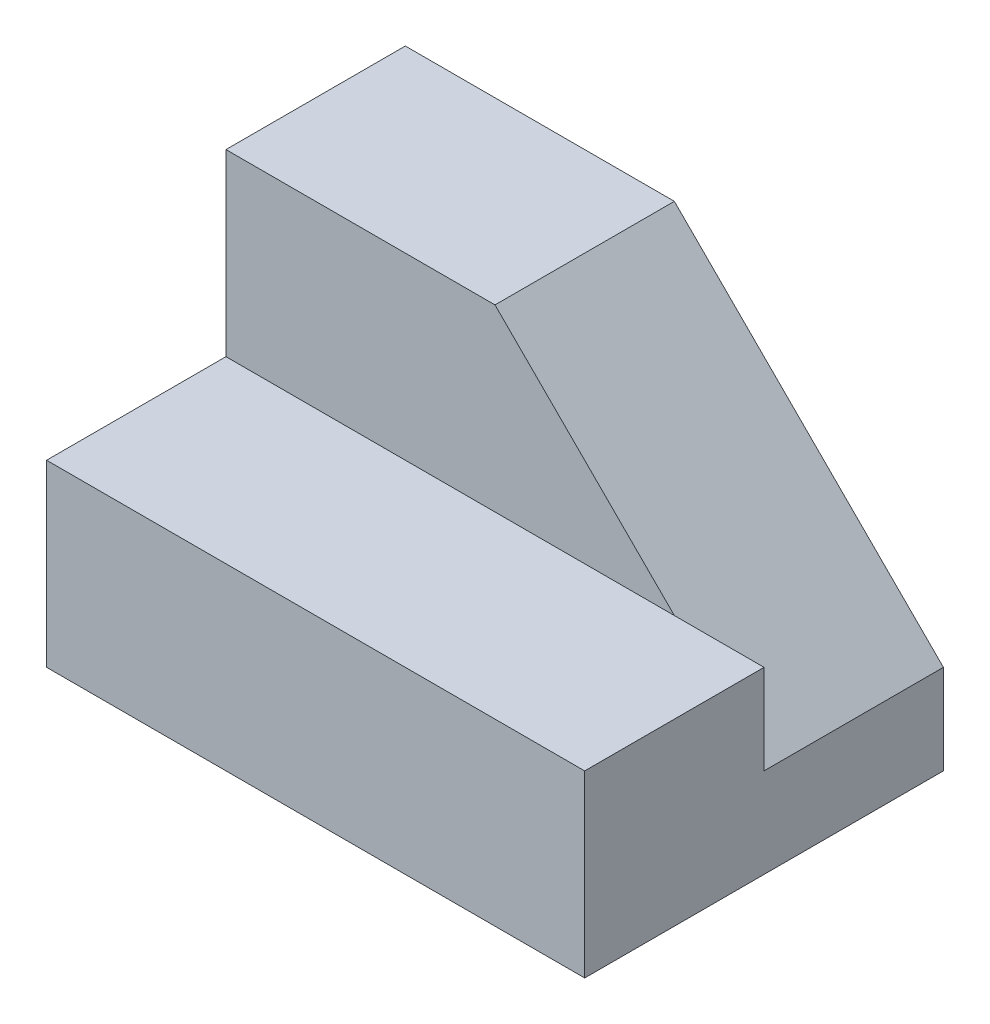
ISO-10303-21;
HEADER;
FILE_DESCRIPTION(('STEP AP214'),'2;1');
FILE_NAME('part.step','',(''),(''),'','','');
FILE_SCHEMA(('AUTOMOTIVE_DESIGN { 1 0 10303 214 1 1 1 1 }'));
ENDSEC;
DATA;
#1=APPLICATION_CONTEXT('core data for automotive mechanical design processes');
#2=APPLICATION_PROTOCOL_DEFINITION('international standard','automotive_design',2000,#1);
#3=PRODUCT_CONTEXT('',#1,'mechanical');
#4=PRODUCT('Part','Part','',(#3));
#5=PRODUCT_RELATED_PRODUCT_CATEGORY('part','',(#4));
#6=PRODUCT_DEFINITION_FORMATION('','',#4);
#7=PRODUCT_DEFINITION_CONTEXT('part definition',#1,'design');
#8=PRODUCT_DEFINITION('design','',#6,#7);
#9=PRODUCT_DEFINITION_SHAPE('','',#8);
#10=(LENGTH_UNIT() NAMED_UNIT(*) SI_UNIT(.MILLI.,.METRE.));
#11=(NAMED_UNIT(*) PLANE_ANGLE_UNIT() SI_UNIT($,.RADIAN.));
#12=(NAMED_UNIT(*) SI_UNIT($,.STERADIAN.) SOLID_ANGLE_UNIT());
#13=UNCERTAINTY_MEASURE_WITH_UNIT(LENGTH_MEASURE(1.E-05),#10,'distance_accuracy_value','');
#14=(GEOMETRIC_REPRESENTATION_CONTEXT(3) GLOBAL_UNCERTAINTY_ASSIGNED_CONTEXT((#13)) GLOBAL_UNIT_ASSIGNED_CONTEXT((#10,
#11,#12)) REPRESENTATION_CONTEXT('',''));
#15=CARTESIAN_POINT('',(0.,0.,0.));
#16=DIRECTION('',(0.,0.,1.));
#17=DIRECTION('',(1.,0.,0.));
#18=AXIS2_PLACEMENT_3D('',#15,#16,#17);
#19=CARTESIAN_POINT('',(-1.14285714285714,7.90476190476191,-0.952380952380954));
#20=DIRECTION('',(0.,1.,0.));
#21=DIRECTION('',(0.,0.,1.));
#22=AXIS2_PLACEMENT_3D('',#19,#20,#21);
#23=PLANE('',#22);
#24=DIRECTION('',(0.,0.,1.));
#25=VECTOR('',#24,1.);
#26=CARTESIAN_POINT('',(1.85714285714285,7.90476190476191,-0.952380952380954));
#27=LINE('',#26,#25);
#28=CARTESIAN_POINT('',(1.85714285714285,7.90476190476191,-0.952380952380954));
#29=VERTEX_POINT('',#28);
#30=CARTESIAN_POINT('',(1.85714285714286,7.90476190476191,1.04761904761905));
#31=VERTEX_POINT('',#30);
#32=EDGE_CURVE('E62',#29,#31,#27,.T.);
#33=ORIENTED_EDGE('',*,*,#32,.F.);
#34=DIRECTION('',(-1.,0.,0.));
#35=VECTOR('',#34,1.);
#36=CARTESIAN_POINT('',(-1.14285714285714,7.90476190476191,-0.952380952380954));
#37=LINE('',#36,#35);
#38=CARTESIAN_POINT('',(0.857142857142855,7.90476190476191,-0.952380952380954));
#39=VERTEX_POINT('',#38);
#40=EDGE_CURVE('E90',#29,#39,#37,.T.);
#41=ORIENTED_EDGE('',*,*,#40,.T.);
#42=CARTESIAN_POINT('',(-4.14285714285715,7.90476190476191,-0.952380952380954));
#43=VERTEX_POINT('',#42);
#44=EDGE_CURVE('E127',#39,#43,#37,.T.);
#45=ORIENTED_EDGE('',*,*,#44,.T.);
#46=DIRECTION('',(0.,0.,1.));
#47=VECTOR('',#46,1.);
#48=CARTESIAN_POINT('',(-4.14285714285715,7.90476190476191,-0.952380952380953));
#49=LINE('',#48,#47);
#50=CARTESIAN_POINT('',(-4.14285714285715,7.90476190476191,1.04761904761905));
#51=VERTEX_POINT('',#50);
#52=EDGE_CURVE('E105',#43,#51,#49,.T.);
#53=ORIENTED_EDGE('',*,*,#52,.T.);
#54=DIRECTION('',(1.,0.,0.));
#55=VECTOR('',#54,1.);
#56=CARTESIAN_POINT('',(-1.14285714285714,7.90476190476191,1.04761904761905));
#57=LINE('',#56,#55);
#58=EDGE_CURVE('E98',#51,#31,#57,.T.);
#59=ORIENTED_EDGE('',*,*,#58,.T.);
#60=EDGE_LOOP('',(#33,#41,#45,#53,#59));
#61=FACE_BOUND('',#60,.T.);
#62=ADVANCED_FACE('F38',(#61),#23,.T.);
#63=CARTESIAN_POINT('',(1.85714285714285,7.90476190476191,-0.952380952380954));
#64=DIRECTION('',(1.,0.,0.));
#65=DIRECTION('',(0.,0.,-1.));
#66=AXIS2_PLACEMENT_3D('',#63,#64,#65);
#67=PLANE('',#66);
#68=DIRECTION('',(0.,0.,-1.));
#69=VECTOR('',#68,1.);
#70=CARTESIAN_POINT('',(1.85714285714285,6.90476190476191,-0.952380952380954));
#71=LINE('',#70,#69);
#72=CARTESIAN_POINT('',(1.85714285714285,6.90476190476191,-0.952380952380954));
#73=VERTEX_POINT('',#72);
#74=CARTESIAN_POINT('',(1.85714285714285,6.90476190476191,-2.95238095238095));
#75=VERTEX_POINT('',#74);
#76=EDGE_CURVE('E138',#73,#75,#71,.T.);
#77=ORIENTED_EDGE('',*,*,#76,.F.);
#78=DIRECTION('',(0.,-1.,0.));
#79=VECTOR('',#78,1.);
#80=CARTESIAN_POINT('',(1.85714285714285,9.90476190476191,-0.952380952380954));
#81=LINE('',#80,#79);
#82=EDGE_CURVE('E143',#29,#73,#81,.T.);
#83=ORIENTED_EDGE('',*,*,#82,.F.);
#84=ORIENTED_EDGE('',*,*,#32,.T.);
#85=DIRECTION('',(0.,-1.,0.));
#86=VECTOR('',#85,1.);
#87=CARTESIAN_POINT('',(1.85714285714286,7.90476190476191,1.04761904761905));
#88=LINE('',#87,#86);
#89=CARTESIAN_POINT('',(1.85714285714286,5.90476190476191,1.04761904761905));
#90=VERTEX_POINT('',#89);
#91=EDGE_CURVE('E93',#31,#90,#88,.T.);
#92=ORIENTED_EDGE('',*,*,#91,.T.);
#93=DIRECTION('',(0.,0.,1.));
#94=VECTOR('',#93,1.);
#95=CARTESIAN_POINT('',(1.85714285714285,5.90476190476191,-0.952380952380954));
#96=LINE('',#95,#94);
#97=CARTESIAN_POINT('',(1.85714285714285,5.90476190476191,-2.95238095238095));
#98=VERTEX_POINT('',#97);
#99=EDGE_CURVE('E82',#98,#90,#96,.T.);
#100=ORIENTED_EDGE('',*,*,#99,.F.);
#101=DIRECTION('',(0.,-1.,0.));
#102=VECTOR('',#101,1.);
#103=CARTESIAN_POINT('',(1.85714285714285,7.90476190476191,-2.95238095238095));
#104=LINE('',#103,#102);
#105=EDGE_CURVE('E11',#75,#98,#104,.T.);
#106=ORIENTED_EDGE('',*,*,#105,.F.);
#107=EDGE_LOOP('',(#77,#83,#84,#92,#100,#106));
#108=FACE_BOUND('',#107,.T.);
#109=ADVANCED_FACE('F40',(#108),#67,.T.);
#110=CARTESIAN_POINT('',(-1.14285714285714,7.90476190476191,-2.95238095238095));
#111=DIRECTION('',(0.,0.,-1.));
#112=DIRECTION('',(-1.,0.,0.));
#113=AXIS2_PLACEMENT_3D('',#110,#111,#112);
#114=PLANE('',#113);
#115=DIRECTION('',(-0.707106781186547,0.707106781186547,0.));
#116=VECTOR('',#115,1.);
#117=CARTESIAN_POINT('',(1.85714285714285,6.90476190476191,-2.95238095238095));
#118=LINE('',#117,#116);
#119=CARTESIAN_POINT('',(-1.14285714285715,9.90476190476191,-2.95238095238095));
#120=VERTEX_POINT('',#119);
#121=EDGE_CURVE('E53',#75,#120,#118,.T.);
#122=ORIENTED_EDGE('',*,*,#121,.F.);
#123=ORIENTED_EDGE('',*,*,#105,.T.);
#124=DIRECTION('',(1.,0.,0.));
#125=VECTOR('',#124,1.);
#126=CARTESIAN_POINT('',(-1.14285714285714,5.90476190476191,-2.95238095238095));
#127=LINE('',#126,#125);
#128=CARTESIAN_POINT('',(-4.14285714285715,5.90476190476191,-2.95238095238095));
#129=VERTEX_POINT('',#128);
#130=EDGE_CURVE('E88',#129,#98,#127,.T.);
#131=ORIENTED_EDGE('',*,*,#130,.F.);
#132=DIRECTION('',(0.,-1.,0.));
#133=VECTOR('',#132,1.);
#134=CARTESIAN_POINT('',(-4.14285714285715,7.90476190476191,-2.95238095238095));
#135=LINE('',#134,#133);
#136=CARTESIAN_POINT('',(-4.14285714285715,9.90476190476191,-2.95238095238095));
#137=VERTEX_POINT('',#136);
#138=EDGE_CURVE('E46',#137,#129,#135,.T.);
#139=ORIENTED_EDGE('',*,*,#138,.F.);
#140=DIRECTION('',(1.,0.,0.));
#141=VECTOR('',#140,1.);
#142=CARTESIAN_POINT('',(-1.14285714285714,9.90476190476191,-2.95238095238095));
#143=LINE('',#142,#141);
#144=EDGE_CURVE('E132',#137,#120,#143,.T.);
#145=ORIENTED_EDGE('',*,*,#144,.T.);
#146=EDGE_LOOP('',(#122,#123,#131,#139,#145));
#147=FACE_BOUND('',#146,.T.);
#148=ADVANCED_FACE('F121',(#147),#114,.T.);
#149=CARTESIAN_POINT('',(-4.14285714285715,7.90476190476191,-0.952380952380953));
#150=DIRECTION('',(1.,0.,0.));
#151=DIRECTION('',(0.,0.,-1.));
#152=AXIS2_PLACEMENT_3D('',#149,#150,#151);
#153=PLANE('',#152);
#154=DIRECTION('',(0.,0.,1.));
#155=VECTOR('',#154,1.);
#156=CARTESIAN_POINT('',(-4.14285714285715,5.90476190476191,-0.952380952380953));
#157=LINE('',#156,#155);
#158=CARTESIAN_POINT('',(-4.14285714285715,5.90476190476191,1.04761904761905));
#159=VERTEX_POINT('',#158);
#160=EDGE_CURVE('E103',#129,#159,#157,.T.);
#161=ORIENTED_EDGE('',*,*,#160,.T.);
#162=DIRECTION('',(0.,-1.,0.));
#163=VECTOR('',#162,1.);
#164=CARTESIAN_POINT('',(-4.14285714285715,7.90476190476191,1.04761904761905));
#165=LINE('',#164,#163);
#166=EDGE_CURVE('E97',#51,#159,#165,.T.);
#167=ORIENTED_EDGE('',*,*,#166,.F.);
#168=ORIENTED_EDGE('',*,*,#52,.F.);
#169=DIRECTION('',(0.,-1.,0.));
#170=VECTOR('',#169,1.);
#171=CARTESIAN_POINT('',(-4.14285714285715,9.90476190476191,-0.952380952380954));
#172=LINE('',#171,#170);
#173=CARTESIAN_POINT('',(-4.14285714285715,9.90476190476191,-0.952380952380954));
#174=VERTEX_POINT('',#173);
#175=EDGE_CURVE('E128',#174,#43,#172,.T.);
#176=ORIENTED_EDGE('',*,*,#175,.F.);
#177=DIRECTION('',(0.,0.,1.));
#178=VECTOR('',#177,1.);
#179=CARTESIAN_POINT('',(-4.14285714285715,9.90476190476191,-0.952380952380953));
#180=LINE('',#179,#178);
#181=EDGE_CURVE('E117',#137,#174,#180,.T.);
#182=ORIENTED_EDGE('',*,*,#181,.F.);
#183=ORIENTED_EDGE('',*,*,#138,.T.);
#184=EDGE_LOOP('',(#161,#167,#168,#176,#182,#183));
#185=FACE_BOUND('',#184,.T.);
#186=ADVANCED_FACE('F113',(#185),#153,.F.);
#187=CARTESIAN_POINT('',(-1.14285714285714,7.90476190476191,1.04761904761905));
#188=DIRECTION('',(0.,0.,-1.));
#189=DIRECTION('',(-1.,0.,0.));
#190=AXIS2_PLACEMENT_3D('',#187,#188,#189);
#191=PLANE('',#190);
#192=DIRECTION('',(1.,0.,0.));
#193=VECTOR('',#192,1.);
#194=CARTESIAN_POINT('',(-1.14285714285714,5.90476190476191,1.04761904761905));
#195=LINE('',#194,#193);
#196=EDGE_CURVE('E86',#159,#90,#195,.T.);
#197=ORIENTED_EDGE('',*,*,#196,.T.);
#198=ORIENTED_EDGE('',*,*,#91,.F.);
#199=ORIENTED_EDGE('',*,*,#58,.F.);
#200=ORIENTED_EDGE('',*,*,#166,.T.);
#201=EDGE_LOOP('',(#197,#198,#199,#200));
#202=FACE_BOUND('',#201,.T.);
#203=ADVANCED_FACE('F101',(#202),#191,.F.);
#204=CARTESIAN_POINT('',(-1.14285714285714,5.90476190476191,-0.952380952380954));
#205=DIRECTION('',(0.,1.,0.));
#206=DIRECTION('',(0.,0.,1.));
#207=AXIS2_PLACEMENT_3D('',#204,#205,#206);
#208=PLANE('',#207);
#209=ORIENTED_EDGE('',*,*,#99,.T.);
#210=ORIENTED_EDGE('',*,*,#196,.F.);
#211=ORIENTED_EDGE('',*,*,#160,.F.);
#212=ORIENTED_EDGE('',*,*,#130,.T.);
#213=EDGE_LOOP('',(#209,#210,#211,#212));
#214=FACE_BOUND('',#213,.T.);
#215=ADVANCED_FACE('F83',(#214),#208,.F.);
#216=CARTESIAN_POINT('',(-1.14285714285714,9.90476190476191,-0.952380952380954));
#217=DIRECTION('',(0.,0.,-1.));
#218=DIRECTION('',(-1.,0.,0.));
#219=AXIS2_PLACEMENT_3D('',#216,#217,#218);
#220=PLANE('',#219);
#221=ORIENTED_EDGE('',*,*,#44,.F.);
#222=DIRECTION('',(-0.707106781186547,0.707106781186547,0.));
#223=VECTOR('',#222,1.);
#224=CARTESIAN_POINT('',(1.85714285714285,6.90476190476191,-0.952380952380954));
#225=LINE('',#224,#223);
#226=CARTESIAN_POINT('',(-1.14285714285715,9.90476190476191,-0.952380952380954));
#227=VERTEX_POINT('',#226);
#228=EDGE_CURVE('E146',#39,#227,#225,.T.);
#229=ORIENTED_EDGE('',*,*,#228,.T.);
#230=DIRECTION('',(1.,0.,0.));
#231=VECTOR('',#230,1.);
#232=CARTESIAN_POINT('',(-1.14285714285714,9.90476190476191,-0.952380952380954));
#233=LINE('',#232,#231);
#234=EDGE_CURVE('E134',#174,#227,#233,.T.);
#235=ORIENTED_EDGE('',*,*,#234,.F.);
#236=ORIENTED_EDGE('',*,*,#175,.T.);
#237=EDGE_LOOP('',(#221,#229,#235,#236));
#238=FACE_BOUND('',#237,.T.);
#239=ADVANCED_FACE('F158',(#238),#220,.F.);
#240=CARTESIAN_POINT('',(-1.14285714285714,9.90476190476191,-0.952380952380954));
#241=DIRECTION('',(0.,1.,0.));
#242=DIRECTION('',(0.,0.,1.));
#243=AXIS2_PLACEMENT_3D('',#240,#241,#242);
#244=PLANE('',#243);
#245=DIRECTION('',(0.,0.,-1.));
#246=VECTOR('',#245,1.);
#247=CARTESIAN_POINT('',(-1.14285714285715,9.90476190476191,-0.952380952380954));
#248=LINE('',#247,#246);
#249=EDGE_CURVE('E137',#227,#120,#248,.T.);
#250=ORIENTED_EDGE('',*,*,#249,.T.);
#251=ORIENTED_EDGE('',*,*,#144,.F.);
#252=ORIENTED_EDGE('',*,*,#181,.T.);
#253=ORIENTED_EDGE('',*,*,#234,.T.);
#254=EDGE_LOOP('',(#250,#251,#252,#253));
#255=FACE_BOUND('',#254,.T.);
#256=ADVANCED_FACE('F165',(#255),#244,.T.);
#257=CARTESIAN_POINT('',(1.85714285714285,6.90476190476191,-0.952380952380954));
#258=DIRECTION('',(-0.707106781186548,-0.707106781186548,0.));
#259=DIRECTION('',(0.707106781186548,-0.707106781186548,0.));
#260=AXIS2_PLACEMENT_3D('',#257,#258,#259);
#261=PLANE('',#260);
#262=ORIENTED_EDGE('',*,*,#121,.T.);
#263=ORIENTED_EDGE('',*,*,#249,.F.);
#264=ORIENTED_EDGE('',*,*,#228,.F.);
#265=EDGE_CURVE('E140',#73,#39,#225,.T.);
#266=ORIENTED_EDGE('',*,*,#265,.F.);
#267=ORIENTED_EDGE('',*,*,#76,.T.);
#268=EDGE_LOOP('',(#262,#263,#264,#266,#267));
#269=FACE_BOUND('',#268,.T.);
#270=ADVANCED_FACE('F175',(#269),#261,.F.);
#271=CARTESIAN_POINT('',(-1.14285714285714,5.90476190476191,-0.952380952380954));
#272=DIRECTION('',(0.,0.,1.));
#273=DIRECTION('',(1.,0.,0.));
#274=AXIS2_PLACEMENT_3D('',#271,#272,#273);
#275=PLANE('',#274);
#276=ORIENTED_EDGE('',*,*,#40,.F.);
#277=ORIENTED_EDGE('',*,*,#82,.T.);
#278=ORIENTED_EDGE('',*,*,#265,.T.);
#279=EDGE_LOOP('',(#276,#277,#278));
#280=FACE_BOUND('',#279,.T.);
#281=ADVANCED_FACE('F176',(#280),#275,.F.);
#282=CLOSED_SHELL('',(#62,#109,#148,#186,#203,#215,#239,#256,#270,#281));
#283=MANIFOLD_SOLID_BREP('B2',#282);
#284=ADVANCED_BREP_SHAPE_REPRESENTATION('',(#18,#283),#14);
#285=SHAPE_DEFINITION_REPRESENTATION(#9,#284);
ENDSEC;
END-ISO-10303-21;
